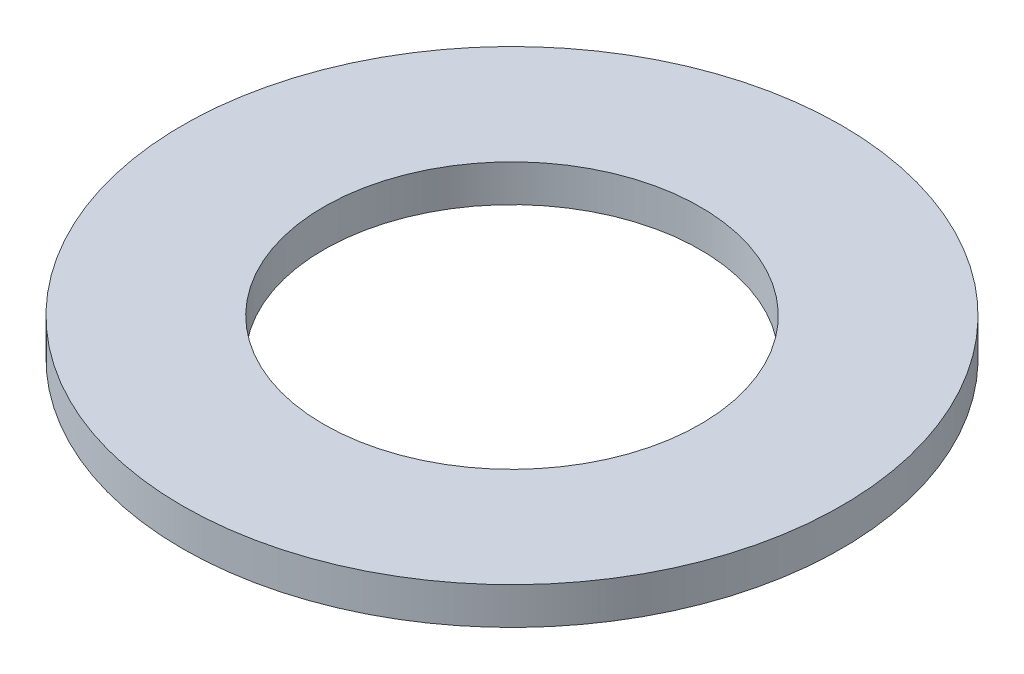
ISO-10303-21;
HEADER;
FILE_DESCRIPTION(('STEP AP214'),'2;1');
FILE_NAME('part.step','',(''),(''),'','','');
FILE_SCHEMA(('AUTOMOTIVE_DESIGN { 1 0 10303 214 1 1 1 1 }'));
ENDSEC;
DATA;
#1=APPLICATION_CONTEXT('core data for automotive mechanical design processes');
#2=APPLICATION_PROTOCOL_DEFINITION('international standard','automotive_design',2000,#1);
#3=PRODUCT_CONTEXT('',#1,'mechanical');
#4=PRODUCT('Part','Part','',(#3));
#5=PRODUCT_RELATED_PRODUCT_CATEGORY('part','',(#4));
#6=PRODUCT_DEFINITION_FORMATION('','',#4);
#7=PRODUCT_DEFINITION_CONTEXT('part definition',#1,'design');
#8=PRODUCT_DEFINITION('design','',#6,#7);
#9=PRODUCT_DEFINITION_SHAPE('','',#8);
#10=(LENGTH_UNIT() NAMED_UNIT(*) SI_UNIT(.MILLI.,.METRE.));
#11=(NAMED_UNIT(*) PLANE_ANGLE_UNIT() SI_UNIT($,.RADIAN.));
#12=(NAMED_UNIT(*) SI_UNIT($,.STERADIAN.) SOLID_ANGLE_UNIT());
#13=UNCERTAINTY_MEASURE_WITH_UNIT(LENGTH_MEASURE(1.E-05),#10,'distance_accuracy_value','');
#14=(GEOMETRIC_REPRESENTATION_CONTEXT(3) GLOBAL_UNCERTAINTY_ASSIGNED_CONTEXT((#13)) GLOBAL_UNIT_ASSIGNED_CONTEXT((#10,
#11,#12)) REPRESENTATION_CONTEXT('',''));
#15=CARTESIAN_POINT('',(0.,0.,0.));
#16=DIRECTION('',(0.,0.,1.));
#17=DIRECTION('',(1.,0.,0.));
#18=AXIS2_PLACEMENT_3D('',#15,#16,#17);
#19=CARTESIAN_POINT('',(0.,10.,0.));
#20=DIRECTION('',(0.,-1.,0.));
#21=DIRECTION('',(0.,0.,-1.));
#22=AXIS2_PLACEMENT_3D('',#19,#20,#21);
#23=CYLINDRICAL_SURFACE('',#22,88.9);
#24=CARTESIAN_POINT('',(0.,10.,0.));
#25=DIRECTION('',(0.,1.,0.));
#26=DIRECTION('',(0.,0.,1.));
#27=AXIS2_PLACEMENT_3D('',#24,#25,#26);
#28=CIRCLE('',#27,88.9);
#29=CARTESIAN_POINT('',(0.,10.,88.9));
#30=VERTEX_POINT('',#29);
#31=EDGE_CURVE('E10',#30,#30,#28,.T.);
#32=ORIENTED_EDGE('',*,*,#31,.F.);
#33=EDGE_LOOP('',(#32));
#34=FACE_BOUND('',#33,.T.);
#35=CARTESIAN_POINT('',(0.,0.,0.));
#36=DIRECTION('',(0.,1.,0.));
#37=DIRECTION('',(0.,0.,1.));
#38=AXIS2_PLACEMENT_3D('',#35,#36,#37);
#39=CIRCLE('',#38,88.9);
#40=CARTESIAN_POINT('',(0.,0.,88.9));
#41=VERTEX_POINT('',#40);
#42=EDGE_CURVE('E35',#41,#41,#39,.T.);
#43=ORIENTED_EDGE('',*,*,#42,.T.);
#44=EDGE_LOOP('',(#43));
#45=FACE_BOUND('',#44,.T.);
#46=ADVANCED_FACE('F32',(#34,#45),#23,.T.);
#47=CARTESIAN_POINT('',(0.,10.,0.));
#48=DIRECTION('',(0.,1.,0.));
#49=DIRECTION('',(0.,0.,1.));
#50=AXIS2_PLACEMENT_3D('',#47,#48,#49);
#51=PLANE('',#50);
#52=CARTESIAN_POINT('',(0.,10.,0.));
#53=DIRECTION('',(0.,1.,0.));
#54=DIRECTION('',(0.,0.,1.));
#55=AXIS2_PLACEMENT_3D('',#52,#53,#54);
#56=CIRCLE('',#55,50.8);
#57=CARTESIAN_POINT('',(0.,10.,50.8));
#58=VERTEX_POINT('',#57);
#59=EDGE_CURVE('E42',#58,#58,#56,.F.);
#60=ORIENTED_EDGE('',*,*,#59,.T.);
#61=EDGE_LOOP('',(#60));
#62=FACE_BOUND('',#61,.T.);
#63=ORIENTED_EDGE('',*,*,#31,.T.);
#64=EDGE_LOOP('',(#63));
#65=FACE_BOUND('',#64,.T.);
#66=ADVANCED_FACE('F60',(#62,#65),#51,.T.);
#67=CARTESIAN_POINT('',(0.,0.,0.));
#68=DIRECTION('',(0.,1.,0.));
#69=DIRECTION('',(0.,0.,1.));
#70=AXIS2_PLACEMENT_3D('',#67,#68,#69);
#71=PLANE('',#70);
#72=CARTESIAN_POINT('',(0.,0.,0.));
#73=DIRECTION('',(0.,1.,0.));
#74=DIRECTION('',(0.,0.,1.));
#75=AXIS2_PLACEMENT_3D('',#72,#73,#74);
#76=CIRCLE('',#75,50.8);
#77=CARTESIAN_POINT('',(0.,0.,50.8));
#78=VERTEX_POINT('',#77);
#79=EDGE_CURVE('E46',#78,#78,#76,.T.);
#80=ORIENTED_EDGE('',*,*,#79,.T.);
#81=EDGE_LOOP('',(#80));
#82=FACE_BOUND('',#81,.T.);
#83=ORIENTED_EDGE('',*,*,#42,.F.);
#84=EDGE_LOOP('',(#83));
#85=FACE_BOUND('',#84,.T.);
#86=ADVANCED_FACE('F50',(#82,#85),#71,.F.);
#87=CARTESIAN_POINT('',(0.,15.,0.));
#88=DIRECTION('',(0.,-1.,0.));
#89=DIRECTION('',(0.,0.,-1.));
#90=AXIS2_PLACEMENT_3D('',#87,#88,#89);
#91=CYLINDRICAL_SURFACE('',#90,50.8);
#92=ORIENTED_EDGE('',*,*,#59,.F.);
#93=EDGE_LOOP('',(#92));
#94=FACE_BOUND('',#93,.T.);
#95=ORIENTED_EDGE('',*,*,#79,.F.);
#96=EDGE_LOOP('',(#95));
#97=FACE_BOUND('',#96,.T.);
#98=ADVANCED_FACE('F53',(#94,#97),#91,.F.);
#99=CLOSED_SHELL('',(#46,#66,#86,#98));
#100=MANIFOLD_SOLID_BREP('B2',#99);
#101=ADVANCED_BREP_SHAPE_REPRESENTATION('',(#18,#100),#14);
#102=SHAPE_DEFINITION_REPRESENTATION(#9,#101);
ENDSEC;
END-ISO-10303-21;
